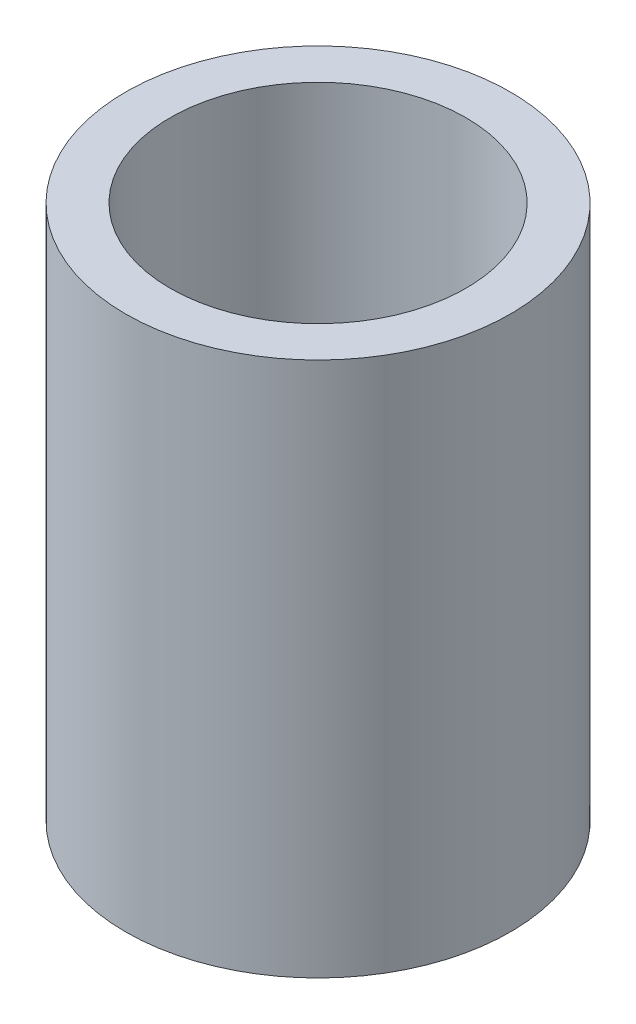
ISO-10303-21;
HEADER;
FILE_DESCRIPTION(('STEP AP214'),'2;1');
FILE_NAME('part.step','',(''),(''),'','','');
FILE_SCHEMA(('AUTOMOTIVE_DESIGN { 1 0 10303 214 1 1 1 1 }'));
ENDSEC;
DATA;
#1=APPLICATION_CONTEXT('core data for automotive mechanical design processes');
#2=APPLICATION_PROTOCOL_DEFINITION('international standard','automotive_design',2000,#1);
#3=PRODUCT_CONTEXT('',#1,'mechanical');
#4=PRODUCT('Part','Part','',(#3));
#5=PRODUCT_RELATED_PRODUCT_CATEGORY('part','',(#4));
#6=PRODUCT_DEFINITION_FORMATION('','',#4);
#7=PRODUCT_DEFINITION_CONTEXT('part definition',#1,'design');
#8=PRODUCT_DEFINITION('design','',#6,#7);
#9=PRODUCT_DEFINITION_SHAPE('','',#8);
#10=(LENGTH_UNIT() NAMED_UNIT(*) SI_UNIT(.MILLI.,.METRE.));
#11=(NAMED_UNIT(*) PLANE_ANGLE_UNIT() SI_UNIT($,.RADIAN.));
#12=(NAMED_UNIT(*) SI_UNIT($,.STERADIAN.) SOLID_ANGLE_UNIT());
#13=UNCERTAINTY_MEASURE_WITH_UNIT(LENGTH_MEASURE(1.E-05),#10,'distance_accuracy_value','');
#14=(GEOMETRIC_REPRESENTATION_CONTEXT(3) GLOBAL_UNCERTAINTY_ASSIGNED_CONTEXT((#13)) GLOBAL_UNIT_ASSIGNED_CONTEXT((#10,
#11,#12)) REPRESENTATION_CONTEXT('',''));
#15=CARTESIAN_POINT('',(0.,0.,0.));
#16=DIRECTION('',(0.,0.,1.));
#17=DIRECTION('',(1.,0.,0.));
#18=AXIS2_PLACEMENT_3D('',#15,#16,#17);
#19=CARTESIAN_POINT('',(0.,97.3809785589766,0.));
#20=DIRECTION('',(0.,-1.,0.));
#21=DIRECTION('',(0.,0.,-1.));
#22=AXIS2_PLACEMENT_3D('',#19,#20,#21);
#23=CYLINDRICAL_SURFACE('',#22,35.);
#24=CARTESIAN_POINT('',(0.,97.3809785589766,0.));
#25=DIRECTION('',(0.,1.,0.));
#26=DIRECTION('',(0.,0.,1.));
#27=AXIS2_PLACEMENT_3D('',#24,#25,#26);
#28=CIRCLE('',#27,35.);
#29=CARTESIAN_POINT('',(0.,97.3809785589766,35.));
#30=VERTEX_POINT('',#29);
#31=EDGE_CURVE('E10',#30,#30,#28,.T.);
#32=ORIENTED_EDGE('',*,*,#31,.F.);
#33=EDGE_LOOP('',(#32));
#34=FACE_BOUND('',#33,.T.);
#35=CARTESIAN_POINT('',(0.,0.,0.));
#36=DIRECTION('',(0.,1.,0.));
#37=DIRECTION('',(0.,0.,1.));
#38=AXIS2_PLACEMENT_3D('',#35,#36,#37);
#39=CIRCLE('',#38,35.);
#40=CARTESIAN_POINT('',(0.,0.,35.));
#41=VERTEX_POINT('',#40);
#42=EDGE_CURVE('E37',#41,#41,#39,.T.);
#43=ORIENTED_EDGE('',*,*,#42,.T.);
#44=EDGE_LOOP('',(#43));
#45=FACE_BOUND('',#44,.T.);
#46=ADVANCED_FACE('F40',(#34,#45),#23,.T.);
#47=CARTESIAN_POINT('',(0.,97.3809785589766,0.));
#48=DIRECTION('',(0.,1.,0.));
#49=DIRECTION('',(0.,0.,1.));
#50=AXIS2_PLACEMENT_3D('',#47,#48,#49);
#51=PLANE('',#50);
#52=CARTESIAN_POINT('',(0.,97.3809785589766,0.));
#53=DIRECTION('',(0.,1.,0.));
#54=DIRECTION('',(0.,0.,1.));
#55=AXIS2_PLACEMENT_3D('',#52,#53,#54);
#56=CIRCLE('',#55,26.9035832821891);
#57=CARTESIAN_POINT('',(0.,97.3809785589766,26.9035832821891));
#58=VERTEX_POINT('',#57);
#59=EDGE_CURVE('E50',#58,#58,#56,.T.);
#60=ORIENTED_EDGE('',*,*,#59,.F.);
#61=EDGE_LOOP('',(#60));
#62=FACE_BOUND('',#61,.T.);
#63=ORIENTED_EDGE('',*,*,#31,.T.);
#64=EDGE_LOOP('',(#63));
#65=FACE_BOUND('',#64,.T.);
#66=ADVANCED_FACE('F59',(#62,#65),#51,.T.);
#67=CARTESIAN_POINT('',(0.,0.,0.));
#68=DIRECTION('',(0.,1.,0.));
#69=DIRECTION('',(0.,0.,1.));
#70=AXIS2_PLACEMENT_3D('',#67,#68,#69);
#71=PLANE('',#70);
#72=CARTESIAN_POINT('',(0.,0.,0.));
#73=DIRECTION('',(0.,1.,0.));
#74=DIRECTION('',(0.,0.,1.));
#75=AXIS2_PLACEMENT_3D('',#72,#73,#74);
#76=CIRCLE('',#75,26.9035832821891);
#77=CARTESIAN_POINT('',(0.,0.,26.9035832821891));
#78=VERTEX_POINT('',#77);
#79=EDGE_CURVE('E47',#78,#78,#76,.T.);
#80=ORIENTED_EDGE('',*,*,#79,.T.);
#81=EDGE_LOOP('',(#80));
#82=FACE_BOUND('',#81,.T.);
#83=ORIENTED_EDGE('',*,*,#42,.F.);
#84=EDGE_LOOP('',(#83));
#85=FACE_BOUND('',#84,.T.);
#86=ADVANCED_FACE('F58',(#82,#85),#71,.F.);
#87=CARTESIAN_POINT('',(0.,97.3809785589766,0.));
#88=DIRECTION('',(0.,-1.,0.));
#89=DIRECTION('',(0.,0.,-1.));
#90=AXIS2_PLACEMENT_3D('',#87,#88,#89);
#91=CYLINDRICAL_SURFACE('',#90,26.9035832821891);
#92=ORIENTED_EDGE('',*,*,#59,.T.);
#93=EDGE_LOOP('',(#92));
#94=FACE_BOUND('',#93,.T.);
#95=ORIENTED_EDGE('',*,*,#79,.F.);
#96=EDGE_LOOP('',(#95));
#97=FACE_BOUND('',#96,.T.);
#98=ADVANCED_FACE('F54',(#94,#97),#91,.F.);
#99=CLOSED_SHELL('',(#46,#66,#86,#98));
#100=MANIFOLD_SOLID_BREP('B2',#99);
#101=ADVANCED_BREP_SHAPE_REPRESENTATION('',(#18,#100),#14);
#102=SHAPE_DEFINITION_REPRESENTATION(#9,#101);
ENDSEC;
END-ISO-10303-21;
